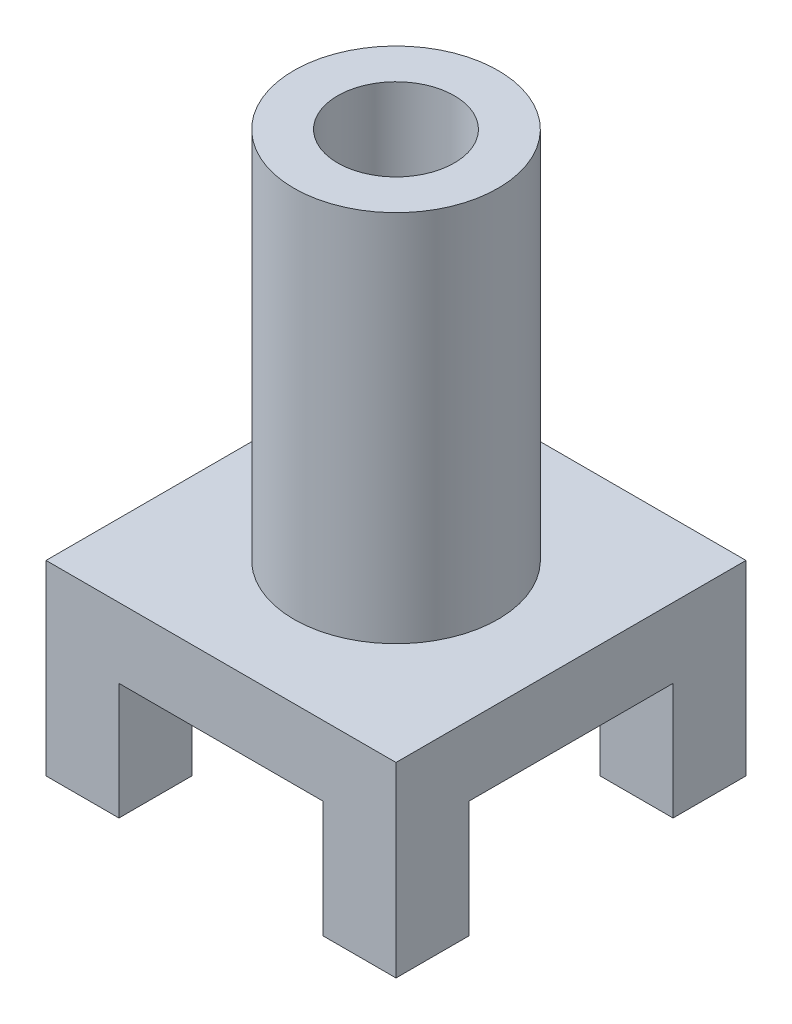
ISO-10303-21;
HEADER;
FILE_DESCRIPTION(('STEP AP214'),'2;1');
FILE_NAME('part.step','',(''),(''),'','','');
FILE_SCHEMA(('AUTOMOTIVE_DESIGN { 1 0 10303 214 1 1 1 1 }'));
ENDSEC;
DATA;
#1=APPLICATION_CONTEXT('core data for automotive mechanical design processes');
#2=APPLICATION_PROTOCOL_DEFINITION('international standard','automotive_design',2000,#1);
#3=PRODUCT_CONTEXT('',#1,'mechanical');
#4=PRODUCT('Part','Part','',(#3));
#5=PRODUCT_RELATED_PRODUCT_CATEGORY('part','',(#4));
#6=PRODUCT_DEFINITION_FORMATION('','',#4);
#7=PRODUCT_DEFINITION_CONTEXT('part definition',#1,'design');
#8=PRODUCT_DEFINITION('design','',#6,#7);
#9=PRODUCT_DEFINITION_SHAPE('','',#8);
#10=(LENGTH_UNIT() NAMED_UNIT(*) SI_UNIT(.MILLI.,.METRE.));
#11=(NAMED_UNIT(*) PLANE_ANGLE_UNIT() SI_UNIT($,.RADIAN.));
#12=(NAMED_UNIT(*) SI_UNIT($,.STERADIAN.) SOLID_ANGLE_UNIT());
#13=UNCERTAINTY_MEASURE_WITH_UNIT(LENGTH_MEASURE(1.E-05),#10,'distance_accuracy_value','');
#14=(GEOMETRIC_REPRESENTATION_CONTEXT(3) GLOBAL_UNCERTAINTY_ASSIGNED_CONTEXT((#13)) GLOBAL_UNIT_ASSIGNED_CONTEXT((#10,
#11,#12)) REPRESENTATION_CONTEXT('',''));
#15=CARTESIAN_POINT('',(0.,0.,0.));
#16=DIRECTION('',(0.,0.,1.));
#17=DIRECTION('',(1.,0.,0.));
#18=AXIS2_PLACEMENT_3D('',#15,#16,#17);
#19=CARTESIAN_POINT('',(0.,0.,0.));
#20=DIRECTION('',(0.,-1.,0.));
#21=DIRECTION('',(0.,0.,-1.));
#22=AXIS2_PLACEMENT_3D('',#19,#20,#21);
#23=PLANE('',#22);
#24=DIRECTION('',(0.,0.,1.));
#25=VECTOR('',#24,1.);
#26=CARTESIAN_POINT('',(-17.5,0.,-30.));
#27=LINE('',#26,#25);
#28=CARTESIAN_POINT('',(-17.5,0.,-30.));
#29=VERTEX_POINT('',#28);
#30=CARTESIAN_POINT('',(-17.5,0.,-17.5));
#31=VERTEX_POINT('',#30);
#32=EDGE_CURVE('E268',#29,#31,#27,.T.);
#33=ORIENTED_EDGE('',*,*,#32,.T.);
#34=DIRECTION('',(1.,0.,0.));
#35=VECTOR('',#34,1.);
#36=CARTESIAN_POINT('',(-30.,0.,-17.5));
#37=LINE('',#36,#35);
#38=CARTESIAN_POINT('',(-30.,0.,-17.5));
#39=VERTEX_POINT('',#38);
#40=EDGE_CURVE('E65',#39,#31,#37,.T.);
#41=ORIENTED_EDGE('',*,*,#40,.F.);
#42=DIRECTION('',(0.,0.,-1.));
#43=VECTOR('',#42,1.);
#44=CARTESIAN_POINT('',(-30.,0.,30.));
#45=LINE('',#44,#43);
#46=CARTESIAN_POINT('',(-30.,0.,-30.));
#47=VERTEX_POINT('',#46);
#48=EDGE_CURVE('E183',#39,#47,#45,.T.);
#49=ORIENTED_EDGE('',*,*,#48,.T.);
#50=DIRECTION('',(-1.,0.,0.));
#51=VECTOR('',#50,1.);
#52=CARTESIAN_POINT('',(30.,0.,-30.));
#53=LINE('',#52,#51);
#54=EDGE_CURVE('E251',#29,#47,#53,.T.);
#55=ORIENTED_EDGE('',*,*,#54,.F.);
#56=EDGE_LOOP('',(#33,#41,#49,#55));
#57=FACE_BOUND('',#56,.T.);
#58=ADVANCED_FACE('F39',(#57),#23,.T.);
#59=DIRECTION('',(0.,0.,-1.));
#60=VECTOR('',#59,1.);
#61=CARTESIAN_POINT('',(30.,0.,30.));
#62=LINE('',#61,#60);
#63=CARTESIAN_POINT('',(30.,0.,-17.5));
#64=VERTEX_POINT('',#63);
#65=CARTESIAN_POINT('',(30.,0.,-30.));
#66=VERTEX_POINT('',#65);
#67=EDGE_CURVE('E195',#64,#66,#62,.T.);
#68=ORIENTED_EDGE('',*,*,#67,.F.);
#69=CARTESIAN_POINT('',(17.5,0.,-17.5));
#70=VERTEX_POINT('',#69);
#71=EDGE_CURVE('E315',#70,#64,#37,.T.);
#72=ORIENTED_EDGE('',*,*,#71,.F.);
#73=DIRECTION('',(0.,0.,1.));
#74=VECTOR('',#73,1.);
#75=CARTESIAN_POINT('',(17.5,0.,-30.));
#76=LINE('',#75,#74);
#77=CARTESIAN_POINT('',(17.5,0.,-30.));
#78=VERTEX_POINT('',#77);
#79=EDGE_CURVE('E249',#78,#70,#76,.T.);
#80=ORIENTED_EDGE('',*,*,#79,.F.);
#81=EDGE_CURVE('E189',#66,#78,#53,.T.);
#82=ORIENTED_EDGE('',*,*,#81,.F.);
#83=EDGE_LOOP('',(#68,#72,#80,#82));
#84=FACE_BOUND('',#83,.T.);
#85=ADVANCED_FACE('F247',(#84),#23,.T.);
#86=CARTESIAN_POINT('',(17.5,0.,-30.));
#87=DIRECTION('',(1.,0.,0.));
#88=DIRECTION('',(0.,0.,-1.));
#89=AXIS2_PLACEMENT_3D('',#86,#87,#88);
#90=PLANE('',#89);
#91=DIRECTION('',(0.,-1.,0.));
#92=VECTOR('',#91,1.);
#93=CARTESIAN_POINT('',(17.5,0.,-17.5));
#94=LINE('',#93,#92);
#95=CARTESIAN_POINT('',(17.5,20.,-17.5));
#96=VERTEX_POINT('',#95);
#97=EDGE_CURVE('E165',#96,#70,#94,.T.);
#98=ORIENTED_EDGE('',*,*,#97,.F.);
#99=DIRECTION('',(0.,0.,1.));
#100=VECTOR('',#99,1.);
#101=CARTESIAN_POINT('',(17.5,20.,-30.));
#102=LINE('',#101,#100);
#103=CARTESIAN_POINT('',(17.5,20.,-30.));
#104=VERTEX_POINT('',#103);
#105=EDGE_CURVE('E254',#104,#96,#102,.T.);
#106=ORIENTED_EDGE('',*,*,#105,.F.);
#107=DIRECTION('',(0.,1.,0.));
#108=VECTOR('',#107,1.);
#109=CARTESIAN_POINT('',(17.5,0.,-30.));
#110=LINE('',#109,#108);
#111=EDGE_CURVE('E295',#78,#104,#110,.T.);
#112=ORIENTED_EDGE('',*,*,#111,.F.);
#113=ORIENTED_EDGE('',*,*,#79,.T.);
#114=EDGE_LOOP('',(#98,#106,#112,#113));
#115=FACE_BOUND('',#114,.T.);
#116=ADVANCED_FACE('F381',(#115),#90,.F.);
#117=CARTESIAN_POINT('',(-17.5,0.,-30.));
#118=DIRECTION('',(1.,0.,0.));
#119=DIRECTION('',(0.,1.,0.));
#120=AXIS2_PLACEMENT_3D('',#117,#118,#119);
#121=PLANE('',#120);
#122=DIRECTION('',(0.,0.,1.));
#123=VECTOR('',#122,1.);
#124=CARTESIAN_POINT('',(-17.5,20.,-30.));
#125=LINE('',#124,#123);
#126=CARTESIAN_POINT('',(-17.5,20.,-30.));
#127=VERTEX_POINT('',#126);
#128=CARTESIAN_POINT('',(-17.5,20.,-17.5));
#129=VERTEX_POINT('',#128);
#130=EDGE_CURVE('E273',#127,#129,#125,.T.);
#131=ORIENTED_EDGE('',*,*,#130,.T.);
#132=DIRECTION('',(0.,-1.,0.));
#133=VECTOR('',#132,1.);
#134=CARTESIAN_POINT('',(-17.5,0.,-17.5));
#135=LINE('',#134,#133);
#136=EDGE_CURVE('E216',#129,#31,#135,.T.);
#137=ORIENTED_EDGE('',*,*,#136,.T.);
#138=ORIENTED_EDGE('',*,*,#32,.F.);
#139=DIRECTION('',(0.,1.,0.));
#140=VECTOR('',#139,1.);
#141=CARTESIAN_POINT('',(-17.5,0.,-30.));
#142=LINE('',#141,#140);
#143=EDGE_CURVE('E292',#29,#127,#142,.T.);
#144=ORIENTED_EDGE('',*,*,#143,.T.);
#145=EDGE_LOOP('',(#131,#137,#138,#144));
#146=FACE_BOUND('',#145,.T.);
#147=ADVANCED_FACE('F387',(#146),#121,.T.);
#148=DIRECTION('',(1.,0.,0.));
#149=VECTOR('',#148,1.);
#150=CARTESIAN_POINT('',(-30.,0.,17.5));
#151=LINE('',#150,#149);
#152=CARTESIAN_POINT('',(-30.,0.,17.5));
#153=VERTEX_POINT('',#152);
#154=CARTESIAN_POINT('',(-17.5,0.,17.5));
#155=VERTEX_POINT('',#154);
#156=EDGE_CURVE('E155',#153,#155,#151,.T.);
#157=ORIENTED_EDGE('',*,*,#156,.T.);
#158=CARTESIAN_POINT('',(-17.5,0.,30.));
#159=VERTEX_POINT('',#158);
#160=EDGE_CURVE('E272',#155,#159,#27,.T.);
#161=ORIENTED_EDGE('',*,*,#160,.T.);
#162=DIRECTION('',(-1.,0.,0.));
#163=VECTOR('',#162,1.);
#164=CARTESIAN_POINT('',(30.,0.,30.));
#165=LINE('',#164,#163);
#166=CARTESIAN_POINT('',(-30.,0.,30.));
#167=VERTEX_POINT('',#166);
#168=EDGE_CURVE('E180',#159,#167,#165,.T.);
#169=ORIENTED_EDGE('',*,*,#168,.T.);
#170=EDGE_CURVE('E171',#167,#153,#45,.T.);
#171=ORIENTED_EDGE('',*,*,#170,.T.);
#172=EDGE_LOOP('',(#157,#161,#169,#171));
#173=FACE_BOUND('',#172,.T.);
#174=ADVANCED_FACE('F178',(#173),#23,.T.);
#175=CARTESIAN_POINT('',(30.,32.,-30.));
#176=DIRECTION('',(0.,0.,1.));
#177=DIRECTION('',(1.,0.,0.));
#178=AXIS2_PLACEMENT_3D('',#175,#176,#177);
#179=PLANE('',#178);
#180=ORIENTED_EDGE('',*,*,#81,.T.);
#181=ORIENTED_EDGE('',*,*,#111,.T.);
#182=DIRECTION('',(1.,0.,0.));
#183=VECTOR('',#182,1.);
#184=CARTESIAN_POINT('',(-17.5,20.,-30.));
#185=LINE('',#184,#183);
#186=EDGE_CURVE('E282',#127,#104,#185,.T.);
#187=ORIENTED_EDGE('',*,*,#186,.F.);
#188=ORIENTED_EDGE('',*,*,#143,.F.);
#189=ORIENTED_EDGE('',*,*,#54,.T.);
#190=DIRECTION('',(0.,-1.,0.));
#191=VECTOR('',#190,1.);
#192=CARTESIAN_POINT('',(-30.,32.,-30.));
#193=LINE('',#192,#191);
#194=CARTESIAN_POINT('',(-30.,32.,-30.));
#195=VERTEX_POINT('',#194);
#196=EDGE_CURVE('E212',#195,#47,#193,.T.);
#197=ORIENTED_EDGE('',*,*,#196,.F.);
#198=DIRECTION('',(-1.,0.,0.));
#199=VECTOR('',#198,1.);
#200=CARTESIAN_POINT('',(30.,32.,-30.));
#201=LINE('',#200,#199);
#202=CARTESIAN_POINT('',(30.,32.,-30.));
#203=VERTEX_POINT('',#202);
#204=EDGE_CURVE('E200',#203,#195,#201,.T.);
#205=ORIENTED_EDGE('',*,*,#204,.F.);
#206=DIRECTION('',(0.,-1.,0.));
#207=VECTOR('',#206,1.);
#208=CARTESIAN_POINT('',(30.,32.,-30.));
#209=LINE('',#208,#207);
#210=EDGE_CURVE('E201',#203,#66,#209,.T.);
#211=ORIENTED_EDGE('',*,*,#210,.T.);
#212=EDGE_LOOP('',(#180,#181,#187,#188,#189,#197,#205,#211));
#213=FACE_BOUND('',#212,.T.);
#214=ADVANCED_FACE('F41',(#213),#179,.F.);
#215=CARTESIAN_POINT('',(-30.,32.,30.));
#216=DIRECTION('',(-1.,0.,0.));
#217=DIRECTION('',(0.,0.,1.));
#218=AXIS2_PLACEMENT_3D('',#215,#216,#217);
#219=PLANE('',#218);
#220=DIRECTION('',(0.,-1.,0.));
#221=VECTOR('',#220,1.);
#222=CARTESIAN_POINT('',(-30.,20.,17.5));
#223=LINE('',#222,#221);
#224=CARTESIAN_POINT('',(-30.,20.,17.5));
#225=VERTEX_POINT('',#224);
#226=EDGE_CURVE('E158',#225,#153,#223,.T.);
#227=ORIENTED_EDGE('',*,*,#226,.T.);
#228=ORIENTED_EDGE('',*,*,#170,.F.);
#229=DIRECTION('',(0.,-1.,0.));
#230=VECTOR('',#229,1.);
#231=CARTESIAN_POINT('',(-30.,32.,30.));
#232=LINE('',#231,#230);
#233=CARTESIAN_POINT('',(-30.,32.,30.));
#234=VERTEX_POINT('',#233);
#235=EDGE_CURVE('E209',#234,#167,#232,.T.);
#236=ORIENTED_EDGE('',*,*,#235,.F.);
#237=DIRECTION('',(0.,0.,-1.));
#238=VECTOR('',#237,1.);
#239=CARTESIAN_POINT('',(-30.,32.,30.));
#240=LINE('',#239,#238);
#241=EDGE_CURVE('E224',#234,#195,#240,.T.);
#242=ORIENTED_EDGE('',*,*,#241,.T.);
#243=ORIENTED_EDGE('',*,*,#196,.T.);
#244=ORIENTED_EDGE('',*,*,#48,.F.);
#245=DIRECTION('',(0.,-1.,0.));
#246=VECTOR('',#245,1.);
#247=CARTESIAN_POINT('',(-30.,20.,-17.5));
#248=LINE('',#247,#246);
#249=CARTESIAN_POINT('',(-30.,20.,-17.5));
#250=VERTEX_POINT('',#249);
#251=EDGE_CURVE('E326',#250,#39,#248,.T.);
#252=ORIENTED_EDGE('',*,*,#251,.F.);
#253=DIRECTION('',(0.,0.,1.));
#254=VECTOR('',#253,1.);
#255=CARTESIAN_POINT('',(-30.,20.,-17.5));
#256=LINE('',#255,#254);
#257=EDGE_CURVE('E174',#250,#225,#256,.T.);
#258=ORIENTED_EDGE('',*,*,#257,.T.);
#259=EDGE_LOOP('',(#227,#228,#236,#242,#243,#244,#252,#258));
#260=FACE_BOUND('',#259,.T.);
#261=ADVANCED_FACE('F170',(#260),#219,.T.);
#262=CARTESIAN_POINT('',(30.,32.,30.));
#263=DIRECTION('',(0.,0.,1.));
#264=DIRECTION('',(1.,0.,0.));
#265=AXIS2_PLACEMENT_3D('',#262,#263,#264);
#266=PLANE('',#265);
#267=DIRECTION('',(0.,1.,0.));
#268=VECTOR('',#267,1.);
#269=CARTESIAN_POINT('',(17.5,0.,30.));
#270=LINE('',#269,#268);
#271=CARTESIAN_POINT('',(17.5,0.,30.));
#272=VERTEX_POINT('',#271);
#273=CARTESIAN_POINT('',(17.5,20.,30.));
#274=VERTEX_POINT('',#273);
#275=EDGE_CURVE('E283',#272,#274,#270,.T.);
#276=ORIENTED_EDGE('',*,*,#275,.F.);
#277=CARTESIAN_POINT('',(30.,0.,30.));
#278=VERTEX_POINT('',#277);
#279=EDGE_CURVE('E187',#278,#272,#165,.T.);
#280=ORIENTED_EDGE('',*,*,#279,.F.);
#281=DIRECTION('',(0.,-1.,0.));
#282=VECTOR('',#281,1.);
#283=CARTESIAN_POINT('',(30.,32.,30.));
#284=LINE('',#283,#282);
#285=CARTESIAN_POINT('',(30.,32.,30.));
#286=VERTEX_POINT('',#285);
#287=EDGE_CURVE('E205',#286,#278,#284,.T.);
#288=ORIENTED_EDGE('',*,*,#287,.F.);
#289=DIRECTION('',(-1.,0.,0.));
#290=VECTOR('',#289,1.);
#291=CARTESIAN_POINT('',(30.,32.,30.));
#292=LINE('',#291,#290);
#293=EDGE_CURVE('E221',#286,#234,#292,.T.);
#294=ORIENTED_EDGE('',*,*,#293,.T.);
#295=ORIENTED_EDGE('',*,*,#235,.T.);
#296=ORIENTED_EDGE('',*,*,#168,.F.);
#297=DIRECTION('',(0.,1.,0.));
#298=VECTOR('',#297,1.);
#299=CARTESIAN_POINT('',(-17.5,0.,30.));
#300=LINE('',#299,#298);
#301=CARTESIAN_POINT('',(-17.5,20.,30.));
#302=VERTEX_POINT('',#301);
#303=EDGE_CURVE('E278',#159,#302,#300,.T.);
#304=ORIENTED_EDGE('',*,*,#303,.T.);
#305=DIRECTION('',(1.,0.,0.));
#306=VECTOR('',#305,1.);
#307=CARTESIAN_POINT('',(-17.5,20.,30.));
#308=LINE('',#307,#306);
#309=EDGE_CURVE('E287',#302,#274,#308,.T.);
#310=ORIENTED_EDGE('',*,*,#309,.T.);
#311=EDGE_LOOP('',(#276,#280,#288,#294,#295,#296,#304,#310));
#312=FACE_BOUND('',#311,.T.);
#313=ADVANCED_FACE('F368',(#312),#266,.T.);
#314=CARTESIAN_POINT('',(30.,32.,30.));
#315=DIRECTION('',(-1.,0.,0.));
#316=DIRECTION('',(0.,0.,1.));
#317=AXIS2_PLACEMENT_3D('',#314,#315,#316);
#318=PLANE('',#317);
#319=CARTESIAN_POINT('',(30.,0.,17.5));
#320=VERTEX_POINT('',#319);
#321=EDGE_CURVE('E196',#278,#320,#62,.T.);
#322=ORIENTED_EDGE('',*,*,#321,.T.);
#323=DIRECTION('',(0.,-1.,0.));
#324=VECTOR('',#323,1.);
#325=CARTESIAN_POINT('',(30.,20.,17.5));
#326=LINE('',#325,#324);
#327=CARTESIAN_POINT('',(30.,20.,17.5));
#328=VERTEX_POINT('',#327);
#329=EDGE_CURVE('E322',#328,#320,#326,.T.);
#330=ORIENTED_EDGE('',*,*,#329,.F.);
#331=DIRECTION('',(0.,0.,1.));
#332=VECTOR('',#331,1.);
#333=CARTESIAN_POINT('',(30.,20.,-17.5));
#334=LINE('',#333,#332);
#335=CARTESIAN_POINT('',(30.,20.,-17.5));
#336=VERTEX_POINT('',#335);
#337=EDGE_CURVE('E318',#336,#328,#334,.T.);
#338=ORIENTED_EDGE('',*,*,#337,.F.);
#339=DIRECTION('',(0.,-1.,0.));
#340=VECTOR('',#339,1.);
#341=CARTESIAN_POINT('',(30.,20.,-17.5));
#342=LINE('',#341,#340);
#343=EDGE_CURVE('E176',#336,#64,#342,.T.);
#344=ORIENTED_EDGE('',*,*,#343,.T.);
#345=ORIENTED_EDGE('',*,*,#67,.T.);
#346=ORIENTED_EDGE('',*,*,#210,.F.);
#347=DIRECTION('',(0.,0.,-1.));
#348=VECTOR('',#347,1.);
#349=CARTESIAN_POINT('',(30.,32.,30.));
#350=LINE('',#349,#348);
#351=EDGE_CURVE('E206',#286,#203,#350,.T.);
#352=ORIENTED_EDGE('',*,*,#351,.F.);
#353=ORIENTED_EDGE('',*,*,#287,.T.);
#354=EDGE_LOOP('',(#322,#330,#338,#344,#345,#346,#352,#353));
#355=FACE_BOUND('',#354,.T.);
#356=ADVANCED_FACE('F235',(#355),#318,.F.);
#357=CARTESIAN_POINT('',(0.,32.,0.));
#358=DIRECTION('',(0.,-1.,0.));
#359=DIRECTION('',(0.,0.,-1.));
#360=AXIS2_PLACEMENT_3D('',#357,#358,#359);
#361=PLANE('',#360);
#362=CARTESIAN_POINT('',(0.,32.,0.));
#363=DIRECTION('',(0.,1.,0.));
#364=DIRECTION('',(0.,0.,1.));
#365=AXIS2_PLACEMENT_3D('',#362,#363,#364);
#366=CIRCLE('',#365,17.5);
#367=CARTESIAN_POINT('',(0.,32.,17.5));
#368=VERTEX_POINT('',#367);
#369=EDGE_CURVE('E11',#368,#368,#366,.T.);
#370=ORIENTED_EDGE('',*,*,#369,.F.);
#371=EDGE_LOOP('',(#370));
#372=FACE_BOUND('',#371,.T.);
#373=ORIENTED_EDGE('',*,*,#204,.T.);
#374=ORIENTED_EDGE('',*,*,#241,.F.);
#375=ORIENTED_EDGE('',*,*,#293,.F.);
#376=ORIENTED_EDGE('',*,*,#351,.T.);
#377=EDGE_LOOP('',(#373,#374,#375,#376));
#378=FACE_BOUND('',#377,.T.);
#379=ADVANCED_FACE('F358',(#372,#378),#361,.F.);
#380=CARTESIAN_POINT('',(17.5,0.,17.5));
#381=VERTEX_POINT('',#380);
#382=EDGE_CURVE('E166',#381,#320,#151,.T.);
#383=ORIENTED_EDGE('',*,*,#382,.T.);
#384=ORIENTED_EDGE('',*,*,#321,.F.);
#385=ORIENTED_EDGE('',*,*,#279,.T.);
#386=EDGE_CURVE('E267',#381,#272,#76,.T.);
#387=ORIENTED_EDGE('',*,*,#386,.F.);
#388=EDGE_LOOP('',(#383,#384,#385,#387));
#389=FACE_BOUND('',#388,.T.);
#390=ADVANCED_FACE('F361',(#389),#23,.T.);
#391=CARTESIAN_POINT('',(-17.5,20.,-30.));
#392=DIRECTION('',(0.,-1.,0.));
#393=DIRECTION('',(0.,0.,-1.));
#394=AXIS2_PLACEMENT_3D('',#391,#392,#393);
#395=PLANE('',#394);
#396=CARTESIAN_POINT('',(0.,20.,0.));
#397=DIRECTION('',(0.,-1.,0.));
#398=DIRECTION('',(0.,0.,-1.));
#399=AXIS2_PLACEMENT_3D('',#396,#397,#398);
#400=CIRCLE('',#399,10.);
#401=CARTESIAN_POINT('',(0.,20.,-10.));
#402=VERTEX_POINT('',#401);
#403=EDGE_CURVE('E334',#402,#402,#400,.T.);
#404=ORIENTED_EDGE('',*,*,#403,.F.);
#405=EDGE_LOOP('',(#404));
#406=FACE_BOUND('',#405,.T.);
#407=CARTESIAN_POINT('',(-17.5,20.,17.5));
#408=VERTEX_POINT('',#407);
#409=EDGE_CURVE('E277',#408,#302,#125,.T.);
#410=ORIENTED_EDGE('',*,*,#409,.F.);
#411=DIRECTION('',(1.,0.,0.));
#412=VECTOR('',#411,1.);
#413=CARTESIAN_POINT('',(-30.,20.,17.5));
#414=LINE('',#413,#412);
#415=EDGE_CURVE('E305',#225,#408,#414,.T.);
#416=ORIENTED_EDGE('',*,*,#415,.F.);
#417=ORIENTED_EDGE('',*,*,#257,.F.);
#418=DIRECTION('',(1.,0.,0.));
#419=VECTOR('',#418,1.);
#420=CARTESIAN_POINT('',(-30.,20.,-17.5));
#421=LINE('',#420,#419);
#422=EDGE_CURVE('E309',#250,#129,#421,.T.);
#423=ORIENTED_EDGE('',*,*,#422,.T.);
#424=ORIENTED_EDGE('',*,*,#130,.F.);
#425=ORIENTED_EDGE('',*,*,#186,.T.);
#426=ORIENTED_EDGE('',*,*,#105,.T.);
#427=EDGE_CURVE('E57',#96,#336,#421,.T.);
#428=ORIENTED_EDGE('',*,*,#427,.T.);
#429=ORIENTED_EDGE('',*,*,#337,.T.);
#430=CARTESIAN_POINT('',(17.5,20.,17.5));
#431=VERTEX_POINT('',#430);
#432=EDGE_CURVE('E308',#431,#328,#414,.T.);
#433=ORIENTED_EDGE('',*,*,#432,.F.);
#434=EDGE_CURVE('E259',#431,#274,#102,.T.);
#435=ORIENTED_EDGE('',*,*,#434,.T.);
#436=ORIENTED_EDGE('',*,*,#309,.F.);
#437=EDGE_LOOP('',(#410,#416,#417,#423,#424,#425,#426,#428,#429,#433,#435,#436));
#438=FACE_BOUND('',#437,.T.);
#439=ADVANCED_FACE('F385',(#406,#438),#395,.T.);
#440=ORIENTED_EDGE('',*,*,#434,.F.);
#441=DIRECTION('',(0.,-1.,0.));
#442=VECTOR('',#441,1.);
#443=CARTESIAN_POINT('',(17.5,0.,17.5));
#444=LINE('',#443,#442);
#445=EDGE_CURVE('E291',#431,#381,#444,.T.);
#446=ORIENTED_EDGE('',*,*,#445,.T.);
#447=ORIENTED_EDGE('',*,*,#386,.T.);
#448=ORIENTED_EDGE('',*,*,#275,.T.);
#449=EDGE_LOOP('',(#440,#446,#447,#448));
#450=FACE_BOUND('',#449,.T.);
#451=ADVANCED_FACE('F399',(#450),#90,.F.);
#452=DIRECTION('',(0.,-1.,0.));
#453=VECTOR('',#452,1.);
#454=CARTESIAN_POINT('',(-17.5,0.,17.5));
#455=LINE('',#454,#453);
#456=EDGE_CURVE('E49',#408,#155,#455,.T.);
#457=ORIENTED_EDGE('',*,*,#456,.F.);
#458=ORIENTED_EDGE('',*,*,#409,.T.);
#459=ORIENTED_EDGE('',*,*,#303,.F.);
#460=ORIENTED_EDGE('',*,*,#160,.F.);
#461=EDGE_LOOP('',(#457,#458,#459,#460));
#462=FACE_BOUND('',#461,.T.);
#463=ADVANCED_FACE('F392',(#462),#121,.T.);
#464=CARTESIAN_POINT('',(-30.,20.,-17.5));
#465=DIRECTION('',(0.,0.,1.));
#466=DIRECTION('',(1.,0.,0.));
#467=AXIS2_PLACEMENT_3D('',#464,#465,#466);
#468=PLANE('',#467);
#469=ORIENTED_EDGE('',*,*,#422,.F.);
#470=ORIENTED_EDGE('',*,*,#251,.T.);
#471=ORIENTED_EDGE('',*,*,#40,.T.);
#472=ORIENTED_EDGE('',*,*,#136,.F.);
#473=EDGE_LOOP('',(#469,#470,#471,#472));
#474=FACE_BOUND('',#473,.T.);
#475=ADVANCED_FACE('F389',(#474),#468,.T.);
#476=CARTESIAN_POINT('',(-30.,20.,17.5));
#477=DIRECTION('',(0.,0.,1.));
#478=DIRECTION('',(0.,-1.,0.));
#479=AXIS2_PLACEMENT_3D('',#476,#477,#478);
#480=PLANE('',#479);
#481=ORIENTED_EDGE('',*,*,#456,.T.);
#482=ORIENTED_EDGE('',*,*,#156,.F.);
#483=ORIENTED_EDGE('',*,*,#226,.F.);
#484=ORIENTED_EDGE('',*,*,#415,.T.);
#485=EDGE_LOOP('',(#481,#482,#483,#484));
#486=FACE_BOUND('',#485,.T.);
#487=ADVANCED_FACE('F157',(#486),#480,.F.);
#488=ORIENTED_EDGE('',*,*,#432,.T.);
#489=ORIENTED_EDGE('',*,*,#329,.T.);
#490=ORIENTED_EDGE('',*,*,#382,.F.);
#491=ORIENTED_EDGE('',*,*,#445,.F.);
#492=EDGE_LOOP('',(#488,#489,#490,#491));
#493=FACE_BOUND('',#492,.T.);
#494=ADVANCED_FACE('F401',(#493),#480,.F.);
#495=ORIENTED_EDGE('',*,*,#97,.T.);
#496=ORIENTED_EDGE('',*,*,#71,.T.);
#497=ORIENTED_EDGE('',*,*,#343,.F.);
#498=ORIENTED_EDGE('',*,*,#427,.F.);
#499=EDGE_LOOP('',(#495,#496,#497,#498));
#500=FACE_BOUND('',#499,.T.);
#501=ADVANCED_FACE('F354',(#500),#468,.T.);
#502=CARTESIAN_POINT('',(0.,96.,0.));
#503=DIRECTION('',(0.,-1.,0.));
#504=DIRECTION('',(0.,0.,-1.));
#505=AXIS2_PLACEMENT_3D('',#502,#503,#504);
#506=CYLINDRICAL_SURFACE('',#505,17.5);
#507=CARTESIAN_POINT('',(0.,96.,0.));
#508=DIRECTION('',(0.,1.,0.));
#509=DIRECTION('',(0.,0.,1.));
#510=AXIS2_PLACEMENT_3D('',#507,#508,#509);
#511=CIRCLE('',#510,17.5);
#512=CARTESIAN_POINT('',(0.,96.,17.5));
#513=VERTEX_POINT('',#512);
#514=EDGE_CURVE('E325',#513,#513,#511,.T.);
#515=ORIENTED_EDGE('',*,*,#514,.F.);
#516=EDGE_LOOP('',(#515));
#517=FACE_BOUND('',#516,.T.);
#518=ORIENTED_EDGE('',*,*,#369,.T.);
#519=EDGE_LOOP('',(#518));
#520=FACE_BOUND('',#519,.T.);
#521=ADVANCED_FACE('F348',(#517,#520),#506,.T.);
#522=CARTESIAN_POINT('',(0.,96.,0.));
#523=DIRECTION('',(0.,1.,0.));
#524=DIRECTION('',(0.,0.,1.));
#525=AXIS2_PLACEMENT_3D('',#522,#523,#524);
#526=PLANE('',#525);
#527=CARTESIAN_POINT('',(0.,96.,0.));
#528=DIRECTION('',(0.,1.,0.));
#529=DIRECTION('',(0.,0.,1.));
#530=AXIS2_PLACEMENT_3D('',#527,#528,#529);
#531=CIRCLE('',#530,10.);
#532=CARTESIAN_POINT('',(0.,96.,10.));
#533=VERTEX_POINT('',#532);
#534=EDGE_CURVE('E43',#533,#533,#531,.T.);
#535=ORIENTED_EDGE('',*,*,#534,.F.);
#536=EDGE_LOOP('',(#535));
#537=FACE_BOUND('',#536,.T.);
#538=ORIENTED_EDGE('',*,*,#514,.T.);
#539=EDGE_LOOP('',(#538));
#540=FACE_BOUND('',#539,.T.);
#541=ADVANCED_FACE('F345',(#537,#540),#526,.T.);
#542=CARTESIAN_POINT('',(0.,0.,0.));
#543=DIRECTION('',(0.,1.,0.));
#544=DIRECTION('',(0.,0.,1.));
#545=AXIS2_PLACEMENT_3D('',#542,#543,#544);
#546=CYLINDRICAL_SURFACE('',#545,10.);
#547=ORIENTED_EDGE('',*,*,#403,.T.);
#548=EDGE_LOOP('',(#547));
#549=FACE_BOUND('',#548,.T.);
#550=ORIENTED_EDGE('',*,*,#534,.T.);
#551=EDGE_LOOP('',(#550));
#552=FACE_BOUND('',#551,.T.);
#553=ADVANCED_FACE('F343',(#549,#552),#546,.F.);
#554=CLOSED_SHELL('',(#58,#85,#116,#147,#174,#214,#261,#313,#356,#379,#390,#439,#451,#463,#475,
#487,#494,#501,#521,#541,#553));
#555=MANIFOLD_SOLID_BREP('B2',#554);
#556=ADVANCED_BREP_SHAPE_REPRESENTATION('',(#18,#555),#14);
#557=SHAPE_DEFINITION_REPRESENTATION(#9,#556);
ENDSEC;
END-ISO-10303-21;
